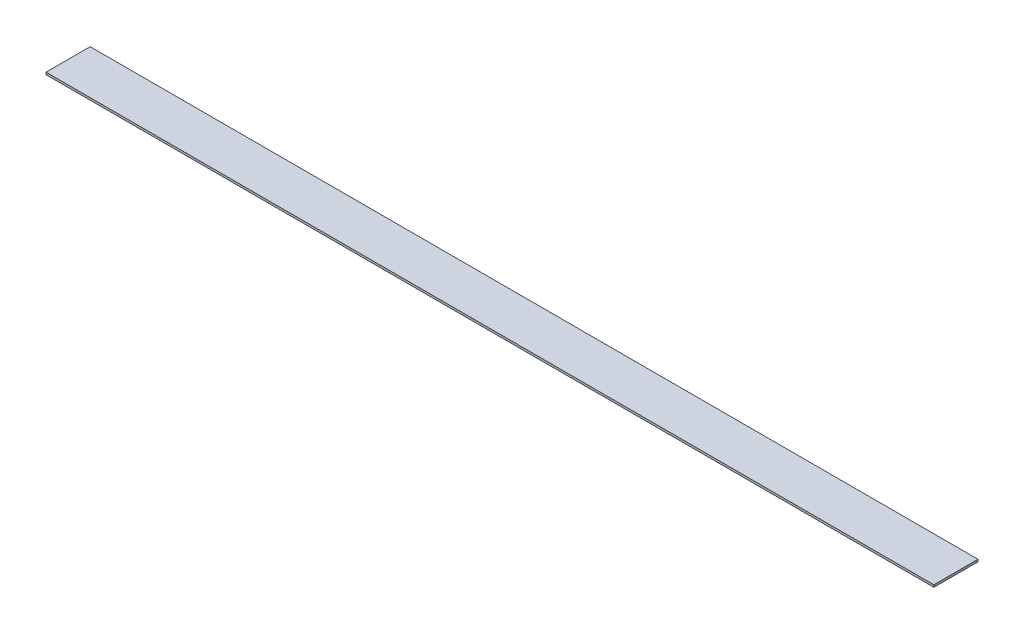
ISO-10303-21;
HEADER;
FILE_DESCRIPTION(('STEP AP214'),'2;1');
FILE_NAME('part.step','',(''),(''),'','','');
FILE_SCHEMA(('AUTOMOTIVE_DESIGN { 1 0 10303 214 1 1 1 1 }'));
ENDSEC;
DATA;
#1=APPLICATION_CONTEXT('core data for automotive mechanical design processes');
#2=APPLICATION_PROTOCOL_DEFINITION('international standard','automotive_design',2000,#1);
#3=PRODUCT_CONTEXT('',#1,'mechanical');
#4=PRODUCT('Part','Part','',(#3));
#5=PRODUCT_RELATED_PRODUCT_CATEGORY('part','',(#4));
#6=PRODUCT_DEFINITION_FORMATION('','',#4);
#7=PRODUCT_DEFINITION_CONTEXT('part definition',#1,'design');
#8=PRODUCT_DEFINITION('design','',#6,#7);
#9=PRODUCT_DEFINITION_SHAPE('','',#8);
#10=(LENGTH_UNIT() NAMED_UNIT(*) SI_UNIT(.MILLI.,.METRE.));
#11=(NAMED_UNIT(*) PLANE_ANGLE_UNIT() SI_UNIT($,.RADIAN.));
#12=(NAMED_UNIT(*) SI_UNIT($,.STERADIAN.) SOLID_ANGLE_UNIT());
#13=UNCERTAINTY_MEASURE_WITH_UNIT(LENGTH_MEASURE(1.E-05),#10,'distance_accuracy_value','');
#14=(GEOMETRIC_REPRESENTATION_CONTEXT(3) GLOBAL_UNCERTAINTY_ASSIGNED_CONTEXT((#13)) GLOBAL_UNIT_ASSIGNED_CONTEXT((#10,
#11,#12)) REPRESENTATION_CONTEXT('',''));
#15=CARTESIAN_POINT('',(0.,0.,0.));
#16=DIRECTION('',(0.,0.,1.));
#17=DIRECTION('',(1.,0.,0.));
#18=AXIS2_PLACEMENT_3D('',#15,#16,#17);
#19=CARTESIAN_POINT('',(0.,0.5,0.));
#20=DIRECTION('',(1.,0.,0.));
#21=DIRECTION('',(0.,0.,-1.));
#22=AXIS2_PLACEMENT_3D('',#19,#20,#21);
#23=PLANE('',#22);
#24=DIRECTION('',(0.,0.,1.));
#25=VECTOR('',#24,1.);
#26=CARTESIAN_POINT('',(0.,0.,0.));
#27=LINE('',#26,#25);
#28=CARTESIAN_POINT('',(0.,0.,-10.));
#29=VERTEX_POINT('',#28);
#30=CARTESIAN_POINT('',(0.,0.,0.));
#31=VERTEX_POINT('',#30);
#32=EDGE_CURVE('E111',#29,#31,#27,.T.);
#33=ORIENTED_EDGE('',*,*,#32,.T.);
#34=DIRECTION('',(0.,-1.,0.));
#35=VECTOR('',#34,1.);
#36=CARTESIAN_POINT('',(0.,0.5,0.));
#37=LINE('',#36,#35);
#38=CARTESIAN_POINT('',(0.,0.5,0.));
#39=VERTEX_POINT('',#38);
#40=EDGE_CURVE('E11',#39,#31,#37,.T.);
#41=ORIENTED_EDGE('',*,*,#40,.F.);
#42=DIRECTION('',(0.,0.,1.));
#43=VECTOR('',#42,1.);
#44=CARTESIAN_POINT('',(0.,0.5,0.));
#45=LINE('',#44,#43);
#46=CARTESIAN_POINT('',(0.,0.5,-10.));
#47=VERTEX_POINT('',#46);
#48=EDGE_CURVE('E95',#47,#39,#45,.T.);
#49=ORIENTED_EDGE('',*,*,#48,.F.);
#50=DIRECTION('',(0.,-1.,0.));
#51=VECTOR('',#50,1.);
#52=CARTESIAN_POINT('',(0.,0.5,-10.));
#53=LINE('',#52,#51);
#54=EDGE_CURVE('E107',#47,#29,#53,.T.);
#55=ORIENTED_EDGE('',*,*,#54,.T.);
#56=EDGE_LOOP('',(#33,#41,#49,#55));
#57=FACE_BOUND('',#56,.T.);
#58=ADVANCED_FACE('F43',(#57),#23,.F.);
#59=CARTESIAN_POINT('',(0.,0.5,0.));
#60=DIRECTION('',(0.,0.,-1.));
#61=DIRECTION('',(-1.,0.,0.));
#62=AXIS2_PLACEMENT_3D('',#59,#60,#61);
#63=PLANE('',#62);
#64=DIRECTION('',(1.,0.,0.));
#65=VECTOR('',#64,1.);
#66=CARTESIAN_POINT('',(0.,0.,0.));
#67=LINE('',#66,#65);
#68=CARTESIAN_POINT('',(201.2,0.,0.));
#69=VERTEX_POINT('',#68);
#70=EDGE_CURVE('E100',#31,#69,#67,.T.);
#71=ORIENTED_EDGE('',*,*,#70,.T.);
#72=DIRECTION('',(0.,-1.,0.));
#73=VECTOR('',#72,1.);
#74=CARTESIAN_POINT('',(201.2,0.5,0.));
#75=LINE('',#74,#73);
#76=CARTESIAN_POINT('',(201.2,0.5,0.));
#77=VERTEX_POINT('',#76);
#78=EDGE_CURVE('E52',#77,#69,#75,.T.);
#79=ORIENTED_EDGE('',*,*,#78,.F.);
#80=DIRECTION('',(1.,0.,0.));
#81=VECTOR('',#80,1.);
#82=CARTESIAN_POINT('',(0.,0.5,0.));
#83=LINE('',#82,#81);
#84=EDGE_CURVE('E90',#39,#77,#83,.T.);
#85=ORIENTED_EDGE('',*,*,#84,.F.);
#86=ORIENTED_EDGE('',*,*,#40,.T.);
#87=EDGE_LOOP('',(#71,#79,#85,#86));
#88=FACE_BOUND('',#87,.T.);
#89=ADVANCED_FACE('F99',(#88),#63,.F.);
#90=CARTESIAN_POINT('',(201.2,0.5,0.));
#91=DIRECTION('',(-1.,0.,0.));
#92=DIRECTION('',(0.,0.,1.));
#93=AXIS2_PLACEMENT_3D('',#90,#91,#92);
#94=PLANE('',#93);
#95=DIRECTION('',(0.,0.,-1.));
#96=VECTOR('',#95,1.);
#97=CARTESIAN_POINT('',(201.2,0.,0.));
#98=LINE('',#97,#96);
#99=CARTESIAN_POINT('',(201.2,0.,-10.));
#100=VERTEX_POINT('',#99);
#101=EDGE_CURVE('E77',#69,#100,#98,.T.);
#102=ORIENTED_EDGE('',*,*,#101,.T.);
#103=DIRECTION('',(0.,-1.,0.));
#104=VECTOR('',#103,1.);
#105=CARTESIAN_POINT('',(201.2,0.5,-10.));
#106=LINE('',#105,#104);
#107=CARTESIAN_POINT('',(201.2,0.5,-10.));
#108=VERTEX_POINT('',#107);
#109=EDGE_CURVE('E102',#108,#100,#106,.T.);
#110=ORIENTED_EDGE('',*,*,#109,.F.);
#111=DIRECTION('',(0.,0.,-1.));
#112=VECTOR('',#111,1.);
#113=CARTESIAN_POINT('',(201.2,0.5,0.));
#114=LINE('',#113,#112);
#115=EDGE_CURVE('E93',#77,#108,#114,.T.);
#116=ORIENTED_EDGE('',*,*,#115,.F.);
#117=ORIENTED_EDGE('',*,*,#78,.T.);
#118=EDGE_LOOP('',(#102,#110,#116,#117));
#119=FACE_BOUND('',#118,.T.);
#120=ADVANCED_FACE('F103',(#119),#94,.F.);
#121=CARTESIAN_POINT('',(0.,0.5,-10.));
#122=DIRECTION('',(0.,0.,1.));
#123=DIRECTION('',(1.,0.,0.));
#124=AXIS2_PLACEMENT_3D('',#121,#122,#123);
#125=PLANE('',#124);
#126=DIRECTION('',(-1.,0.,0.));
#127=VECTOR('',#126,1.);
#128=CARTESIAN_POINT('',(0.,0.,-10.));
#129=LINE('',#128,#127);
#130=EDGE_CURVE('E83',#100,#29,#129,.T.);
#131=ORIENTED_EDGE('',*,*,#130,.T.);
#132=ORIENTED_EDGE('',*,*,#54,.F.);
#133=DIRECTION('',(-1.,0.,0.));
#134=VECTOR('',#133,1.);
#135=CARTESIAN_POINT('',(0.,0.5,-10.));
#136=LINE('',#135,#134);
#137=EDGE_CURVE('E60',#108,#47,#136,.T.);
#138=ORIENTED_EDGE('',*,*,#137,.F.);
#139=ORIENTED_EDGE('',*,*,#109,.T.);
#140=EDGE_LOOP('',(#131,#132,#138,#139));
#141=FACE_BOUND('',#140,.T.);
#142=ADVANCED_FACE('F124',(#141),#125,.F.);
#143=CARTESIAN_POINT('',(0.,0.5,0.));
#144=DIRECTION('',(0.,-1.,0.));
#145=DIRECTION('',(0.,0.,-1.));
#146=AXIS2_PLACEMENT_3D('',#143,#144,#145);
#147=PLANE('',#146);
#148=ORIENTED_EDGE('',*,*,#48,.T.);
#149=ORIENTED_EDGE('',*,*,#84,.T.);
#150=ORIENTED_EDGE('',*,*,#115,.T.);
#151=ORIENTED_EDGE('',*,*,#137,.T.);
#152=EDGE_LOOP('',(#148,#149,#150,#151));
#153=FACE_BOUND('',#152,.T.);
#154=ADVANCED_FACE('F91',(#153),#147,.F.);
#155=CARTESIAN_POINT('',(0.,0.,0.));
#156=DIRECTION('',(0.,-1.,0.));
#157=DIRECTION('',(0.,0.,-1.));
#158=AXIS2_PLACEMENT_3D('',#155,#156,#157);
#159=PLANE('',#158);
#160=ORIENTED_EDGE('',*,*,#32,.F.);
#161=ORIENTED_EDGE('',*,*,#130,.F.);
#162=ORIENTED_EDGE('',*,*,#101,.F.);
#163=ORIENTED_EDGE('',*,*,#70,.F.);
#164=EDGE_LOOP('',(#160,#161,#162,#163));
#165=FACE_BOUND('',#164,.T.);
#166=ADVANCED_FACE('F127',(#165),#159,.T.);
#167=CLOSED_SHELL('',(#58,#89,#120,#142,#154,#166));
#168=MANIFOLD_SOLID_BREP('B2',#167);
#169=ADVANCED_BREP_SHAPE_REPRESENTATION('',(#18,#168),#14);
#170=SHAPE_DEFINITION_REPRESENTATION(#9,#169);
ENDSEC;
END-ISO-10303-21;
